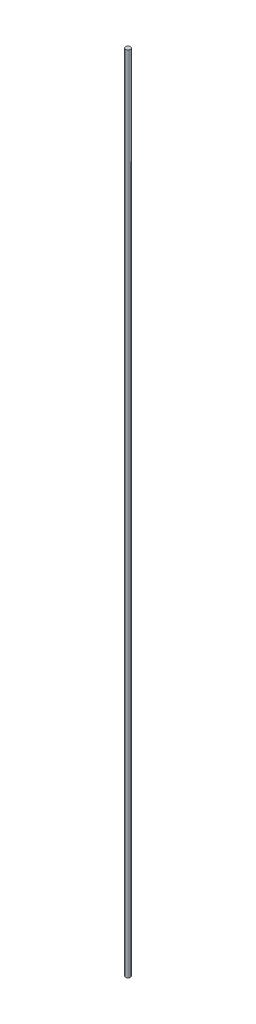
ISO-10303-21;
HEADER;
FILE_DESCRIPTION(('STEP AP214'),'2;1');
FILE_NAME('part.step','',(''),(''),'','','');
FILE_SCHEMA(('AUTOMOTIVE_DESIGN { 1 0 10303 214 1 1 1 1 }'));
ENDSEC;
DATA;
#1=APPLICATION_CONTEXT('core data for automotive mechanical design processes');
#2=APPLICATION_PROTOCOL_DEFINITION('international standard','automotive_design',2000,#1);
#3=PRODUCT_CONTEXT('',#1,'mechanical');
#4=PRODUCT('Part','Part','',(#3));
#5=PRODUCT_RELATED_PRODUCT_CATEGORY('part','',(#4));
#6=PRODUCT_DEFINITION_FORMATION('','',#4);
#7=PRODUCT_DEFINITION_CONTEXT('part definition',#1,'design');
#8=PRODUCT_DEFINITION('design','',#6,#7);
#9=PRODUCT_DEFINITION_SHAPE('','',#8);
#10=(LENGTH_UNIT() NAMED_UNIT(*) SI_UNIT(.MILLI.,.METRE.));
#11=(NAMED_UNIT(*) PLANE_ANGLE_UNIT() SI_UNIT($,.RADIAN.));
#12=(NAMED_UNIT(*) SI_UNIT($,.STERADIAN.) SOLID_ANGLE_UNIT());
#13=UNCERTAINTY_MEASURE_WITH_UNIT(LENGTH_MEASURE(1.E-05),#10,'distance_accuracy_value','');
#14=(GEOMETRIC_REPRESENTATION_CONTEXT(3) GLOBAL_UNCERTAINTY_ASSIGNED_CONTEXT((#13)) GLOBAL_UNIT_ASSIGNED_CONTEXT((#10,
#11,#12)) REPRESENTATION_CONTEXT('',''));
#15=CARTESIAN_POINT('',(0.,0.,0.));
#16=DIRECTION('',(0.,0.,1.));
#17=DIRECTION('',(1.,0.,0.));
#18=AXIS2_PLACEMENT_3D('',#15,#16,#17);
#19=CARTESIAN_POINT('',(0.,1600.2,0.));
#20=DIRECTION('',(0.,-1.,0.));
#21=DIRECTION('',(0.,0.,-1.));
#22=AXIS2_PLACEMENT_3D('',#19,#20,#21);
#23=CYLINDRICAL_SURFACE('',#22,4.7625);
#24=CARTESIAN_POINT('',(0.,1600.2,0.));
#25=DIRECTION('',(0.,1.,0.));
#26=DIRECTION('',(0.,0.,1.));
#27=AXIS2_PLACEMENT_3D('',#24,#25,#26);
#28=CIRCLE('',#27,4.7625);
#29=CARTESIAN_POINT('',(0.,1600.2,4.7625));
#30=VERTEX_POINT('',#29);
#31=EDGE_CURVE('E10',#30,#30,#28,.T.);
#32=ORIENTED_EDGE('',*,*,#31,.F.);
#33=EDGE_LOOP('',(#32));
#34=FACE_BOUND('',#33,.T.);
#35=CARTESIAN_POINT('',(0.,0.,0.));
#36=DIRECTION('',(0.,1.,0.));
#37=DIRECTION('',(0.,0.,1.));
#38=AXIS2_PLACEMENT_3D('',#35,#36,#37);
#39=CIRCLE('',#38,4.7625);
#40=CARTESIAN_POINT('',(0.,0.,4.7625));
#41=VERTEX_POINT('',#40);
#42=EDGE_CURVE('E39',#41,#41,#39,.T.);
#43=ORIENTED_EDGE('',*,*,#42,.T.);
#44=EDGE_LOOP('',(#43));
#45=FACE_BOUND('',#44,.T.);
#46=ADVANCED_FACE('F36',(#34,#45),#23,.T.);
#47=CARTESIAN_POINT('',(0.,1600.2,0.));
#48=DIRECTION('',(0.,1.,0.));
#49=DIRECTION('',(0.,0.,1.));
#50=AXIS2_PLACEMENT_3D('',#47,#48,#49);
#51=PLANE('',#50);
#52=ORIENTED_EDGE('',*,*,#31,.T.);
#53=EDGE_LOOP('',(#52));
#54=FACE_BOUND('',#53,.T.);
#55=ADVANCED_FACE('F53',(#54),#51,.T.);
#56=CARTESIAN_POINT('',(0.,0.,0.));
#57=DIRECTION('',(0.,1.,0.));
#58=DIRECTION('',(0.,0.,1.));
#59=AXIS2_PLACEMENT_3D('',#56,#57,#58);
#60=PLANE('',#59);
#61=ORIENTED_EDGE('',*,*,#42,.F.);
#62=EDGE_LOOP('',(#61));
#63=FACE_BOUND('',#62,.T.);
#64=ADVANCED_FACE('F51',(#63),#60,.F.);
#65=CLOSED_SHELL('',(#46,#55,#64));
#66=MANIFOLD_SOLID_BREP('B2',#65);
#67=ADVANCED_BREP_SHAPE_REPRESENTATION('',(#18,#66),#14);
#68=SHAPE_DEFINITION_REPRESENTATION(#9,#67);
ENDSEC;
END-ISO-10303-21;
